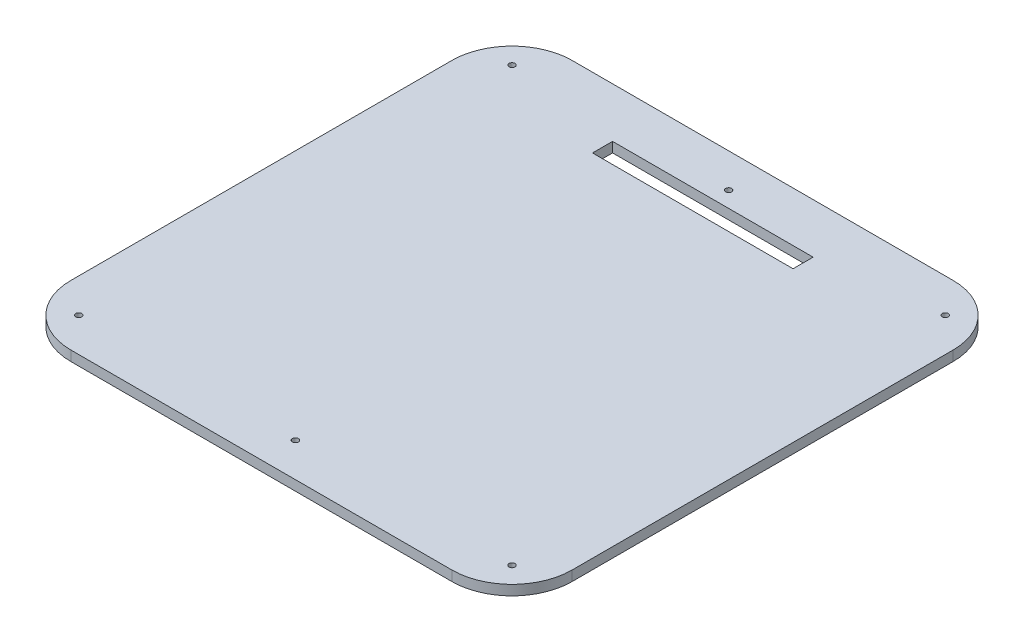
ISO-10303-21;
HEADER;
FILE_DESCRIPTION(('STEP AP214'),'2;1');
FILE_NAME('part.step','',(''),(''),'','','');
FILE_SCHEMA(('AUTOMOTIVE_DESIGN { 1 0 10303 214 1 1 1 1 }'));
ENDSEC;
DATA;
#1=APPLICATION_CONTEXT('core data for automotive mechanical design processes');
#2=APPLICATION_PROTOCOL_DEFINITION('international standard','automotive_design',2000,#1);
#3=PRODUCT_CONTEXT('',#1,'mechanical');
#4=PRODUCT('Part','Part','',(#3));
#5=PRODUCT_RELATED_PRODUCT_CATEGORY('part','',(#4));
#6=PRODUCT_DEFINITION_FORMATION('','',#4);
#7=PRODUCT_DEFINITION_CONTEXT('part definition',#1,'design');
#8=PRODUCT_DEFINITION('design','',#6,#7);
#9=PRODUCT_DEFINITION_SHAPE('','',#8);
#10=(LENGTH_UNIT() NAMED_UNIT(*) SI_UNIT(.MILLI.,.METRE.));
#11=(NAMED_UNIT(*) PLANE_ANGLE_UNIT() SI_UNIT($,.RADIAN.));
#12=(NAMED_UNIT(*) SI_UNIT($,.STERADIAN.) SOLID_ANGLE_UNIT());
#13=UNCERTAINTY_MEASURE_WITH_UNIT(LENGTH_MEASURE(1.E-05),#10,'distance_accuracy_value','');
#14=(GEOMETRIC_REPRESENTATION_CONTEXT(3) GLOBAL_UNCERTAINTY_ASSIGNED_CONTEXT((#13)) GLOBAL_UNIT_ASSIGNED_CONTEXT((#10,
#11,#12)) REPRESENTATION_CONTEXT('',''));
#15=CARTESIAN_POINT('',(0.,0.,0.));
#16=DIRECTION('',(0.,0.,1.));
#17=DIRECTION('',(1.,0.,0.));
#18=AXIS2_PLACEMENT_3D('',#15,#16,#17);
#19=CARTESIAN_POINT('',(125.,2.5,-125.));
#20=DIRECTION('',(-1.,0.,0.));
#21=DIRECTION('',(0.,0.,1.));
#22=AXIS2_PLACEMENT_3D('',#19,#20,#21);
#23=PLANE('',#22);
#24=DIRECTION('',(0.,0.,-1.));
#25=VECTOR('',#24,1.);
#26=CARTESIAN_POINT('',(125.,2.5,-125.));
#27=LINE('',#26,#25);
#28=CARTESIAN_POINT('',(125.,2.5,95.));
#29=VERTEX_POINT('',#28);
#30=CARTESIAN_POINT('',(125.,2.5,-95.));
#31=VERTEX_POINT('',#30);
#32=EDGE_CURVE('E173',#29,#31,#27,.T.);
#33=ORIENTED_EDGE('',*,*,#32,.F.);
#34=DIRECTION('',(0.,-1.,0.));
#35=VECTOR('',#34,1.);
#36=CARTESIAN_POINT('',(125.,2.5,95.));
#37=LINE('',#36,#35);
#38=CARTESIAN_POINT('',(125.,-2.5,95.));
#39=VERTEX_POINT('',#38);
#40=EDGE_CURVE('E220',#29,#39,#37,.T.);
#41=ORIENTED_EDGE('',*,*,#40,.T.);
#42=DIRECTION('',(0.,0.,-1.));
#43=VECTOR('',#42,1.);
#44=CARTESIAN_POINT('',(125.,-2.5,-125.));
#45=LINE('',#44,#43);
#46=CARTESIAN_POINT('',(125.,-2.5,-95.));
#47=VERTEX_POINT('',#46);
#48=EDGE_CURVE('E149',#39,#47,#45,.T.);
#49=ORIENTED_EDGE('',*,*,#48,.T.);
#50=DIRECTION('',(0.,-1.,0.));
#51=VECTOR('',#50,1.);
#52=CARTESIAN_POINT('',(125.,2.5,-95.));
#53=LINE('',#52,#51);
#54=EDGE_CURVE('E218',#47,#31,#53,.F.);
#55=ORIENTED_EDGE('',*,*,#54,.T.);
#56=EDGE_LOOP('',(#33,#41,#49,#55));
#57=FACE_BOUND('',#56,.T.);
#58=ADVANCED_FACE('F39',(#57),#23,.F.);
#59=CARTESIAN_POINT('',(-125.,2.5,-125.));
#60=DIRECTION('',(0.,0.,1.));
#61=DIRECTION('',(1.,0.,0.));
#62=AXIS2_PLACEMENT_3D('',#59,#60,#61);
#63=PLANE('',#62);
#64=DIRECTION('',(-1.,0.,0.));
#65=VECTOR('',#64,1.);
#66=CARTESIAN_POINT('',(-125.,2.5,-125.));
#67=LINE('',#66,#65);
#68=CARTESIAN_POINT('',(95.,2.5,-125.));
#69=VERTEX_POINT('',#68);
#70=CARTESIAN_POINT('',(-95.,2.5,-125.));
#71=VERTEX_POINT('',#70);
#72=EDGE_CURVE('E175',#69,#71,#67,.T.);
#73=ORIENTED_EDGE('',*,*,#72,.F.);
#74=DIRECTION('',(0.,-1.,0.));
#75=VECTOR('',#74,1.);
#76=CARTESIAN_POINT('',(95.,2.5,-125.));
#77=LINE('',#76,#75);
#78=CARTESIAN_POINT('',(95.,-2.5,-125.));
#79=VERTEX_POINT('',#78);
#80=EDGE_CURVE('E11',#69,#79,#77,.T.);
#81=ORIENTED_EDGE('',*,*,#80,.T.);
#82=DIRECTION('',(-1.,0.,0.));
#83=VECTOR('',#82,1.);
#84=CARTESIAN_POINT('',(-125.,-2.5,-125.));
#85=LINE('',#84,#83);
#86=CARTESIAN_POINT('',(-95.,-2.5,-125.));
#87=VERTEX_POINT('',#86);
#88=EDGE_CURVE('E187',#79,#87,#85,.T.);
#89=ORIENTED_EDGE('',*,*,#88,.T.);
#90=DIRECTION('',(0.,-1.,0.));
#91=VECTOR('',#90,1.);
#92=CARTESIAN_POINT('',(-95.,2.5,-125.));
#93=LINE('',#92,#91);
#94=EDGE_CURVE('E47',#87,#71,#93,.F.);
#95=ORIENTED_EDGE('',*,*,#94,.T.);
#96=EDGE_LOOP('',(#73,#81,#89,#95));
#97=FACE_BOUND('',#96,.T.);
#98=ADVANCED_FACE('F234',(#97),#63,.F.);
#99=CARTESIAN_POINT('',(-125.,2.5,-125.));
#100=DIRECTION('',(1.,0.,0.));
#101=DIRECTION('',(0.,0.,-1.));
#102=AXIS2_PLACEMENT_3D('',#99,#100,#101);
#103=PLANE('',#102);
#104=DIRECTION('',(0.,0.,1.));
#105=VECTOR('',#104,1.);
#106=CARTESIAN_POINT('',(-125.,-2.5,-125.));
#107=LINE('',#106,#105);
#108=CARTESIAN_POINT('',(-125.,-2.5,-95.));
#109=VERTEX_POINT('',#108);
#110=CARTESIAN_POINT('',(-125.,-2.5,95.));
#111=VERTEX_POINT('',#110);
#112=EDGE_CURVE('E189',#109,#111,#107,.T.);
#113=ORIENTED_EDGE('',*,*,#112,.T.);
#114=DIRECTION('',(0.,-1.,0.));
#115=VECTOR('',#114,1.);
#116=CARTESIAN_POINT('',(-125.,2.5,95.));
#117=LINE('',#116,#115);
#118=CARTESIAN_POINT('',(-125.,2.5,95.));
#119=VERTEX_POINT('',#118);
#120=EDGE_CURVE('E209',#111,#119,#117,.F.);
#121=ORIENTED_EDGE('',*,*,#120,.T.);
#122=DIRECTION('',(0.,0.,1.));
#123=VECTOR('',#122,1.);
#124=CARTESIAN_POINT('',(-125.,2.5,-125.));
#125=LINE('',#124,#123);
#126=CARTESIAN_POINT('',(-125.,2.5,-95.));
#127=VERTEX_POINT('',#126);
#128=EDGE_CURVE('E178',#127,#119,#125,.T.);
#129=ORIENTED_EDGE('',*,*,#128,.F.);
#130=DIRECTION('',(0.,-1.,0.));
#131=VECTOR('',#130,1.);
#132=CARTESIAN_POINT('',(-125.,2.5,-95.));
#133=LINE('',#132,#131);
#134=EDGE_CURVE('E206',#127,#109,#133,.T.);
#135=ORIENTED_EDGE('',*,*,#134,.T.);
#136=EDGE_LOOP('',(#113,#121,#129,#135));
#137=FACE_BOUND('',#136,.T.);
#138=ADVANCED_FACE('F242',(#137),#103,.F.);
#139=CARTESIAN_POINT('',(-125.,2.5,125.));
#140=DIRECTION('',(0.,0.,-1.));
#141=DIRECTION('',(-1.,0.,0.));
#142=AXIS2_PLACEMENT_3D('',#139,#140,#141);
#143=PLANE('',#142);
#144=DIRECTION('',(1.,0.,0.));
#145=VECTOR('',#144,1.);
#146=CARTESIAN_POINT('',(-125.,2.5,125.));
#147=LINE('',#146,#145);
#148=CARTESIAN_POINT('',(-95.,2.5,125.));
#149=VERTEX_POINT('',#148);
#150=CARTESIAN_POINT('',(95.,2.5,125.));
#151=VERTEX_POINT('',#150);
#152=EDGE_CURVE('E181',#149,#151,#147,.T.);
#153=ORIENTED_EDGE('',*,*,#152,.F.);
#154=DIRECTION('',(0.,-1.,0.));
#155=VECTOR('',#154,1.);
#156=CARTESIAN_POINT('',(-95.,2.5,125.));
#157=LINE('',#156,#155);
#158=CARTESIAN_POINT('',(-95.,-2.5,125.));
#159=VERTEX_POINT('',#158);
#160=EDGE_CURVE('E195',#149,#159,#157,.T.);
#161=ORIENTED_EDGE('',*,*,#160,.T.);
#162=DIRECTION('',(1.,0.,0.));
#163=VECTOR('',#162,1.);
#164=CARTESIAN_POINT('',(-125.,-2.5,125.));
#165=LINE('',#164,#163);
#166=CARTESIAN_POINT('',(95.,-2.5,125.));
#167=VERTEX_POINT('',#166);
#168=EDGE_CURVE('E176',#159,#167,#165,.T.);
#169=ORIENTED_EDGE('',*,*,#168,.T.);
#170=DIRECTION('',(0.,-1.,0.));
#171=VECTOR('',#170,1.);
#172=CARTESIAN_POINT('',(95.,2.5,125.));
#173=LINE('',#172,#171);
#174=EDGE_CURVE('E184',#167,#151,#173,.F.);
#175=ORIENTED_EDGE('',*,*,#174,.T.);
#176=EDGE_LOOP('',(#153,#161,#169,#175));
#177=FACE_BOUND('',#176,.T.);
#178=ADVANCED_FACE('F250',(#177),#143,.F.);
#179=CARTESIAN_POINT('',(0.,2.5,0.));
#180=DIRECTION('',(0.,1.,0.));
#181=DIRECTION('',(0.,0.,1.));
#182=AXIS2_PLACEMENT_3D('',#179,#180,#181);
#183=PLANE('',#182);
#184=CARTESIAN_POINT('',(-108.,2.5,108.));
#185=DIRECTION('',(0.,1.,0.));
#186=DIRECTION('',(0.,0.,-1.));
#187=AXIS2_PLACEMENT_3D('',#184,#185,#186);
#188=CIRCLE('',#187,1.5);
#189=CARTESIAN_POINT('',(-108.,2.5,106.5));
#190=VERTEX_POINT('',#189);
#191=EDGE_CURVE('E342',#190,#190,#188,.T.);
#192=ORIENTED_EDGE('',*,*,#191,.F.);
#193=EDGE_LOOP('',(#192));
#194=FACE_BOUND('',#193,.T.);
#195=CARTESIAN_POINT('',(0.,2.5,108.));
#196=DIRECTION('',(0.,1.,0.));
#197=DIRECTION('',(0.,0.,-1.));
#198=AXIS2_PLACEMENT_3D('',#195,#196,#197);
#199=CIRCLE('',#198,1.5);
#200=CARTESIAN_POINT('',(0.,2.5,106.5));
#201=VERTEX_POINT('',#200);
#202=EDGE_CURVE('E336',#201,#201,#199,.T.);
#203=ORIENTED_EDGE('',*,*,#202,.F.);
#204=EDGE_LOOP('',(#203));
#205=FACE_BOUND('',#204,.T.);
#206=CARTESIAN_POINT('',(108.,2.5,108.));
#207=DIRECTION('',(0.,1.,0.));
#208=DIRECTION('',(0.,0.,1.));
#209=AXIS2_PLACEMENT_3D('',#206,#207,#208);
#210=CIRCLE('',#209,1.5);
#211=CARTESIAN_POINT('',(108.,2.5,109.5));
#212=VERTEX_POINT('',#211);
#213=EDGE_CURVE('E331',#212,#212,#210,.T.);
#214=ORIENTED_EDGE('',*,*,#213,.F.);
#215=EDGE_LOOP('',(#214));
#216=FACE_BOUND('',#215,.T.);
#217=CARTESIAN_POINT('',(108.,2.5,-108.));
#218=DIRECTION('',(0.,1.,0.));
#219=DIRECTION('',(0.,0.,-1.));
#220=AXIS2_PLACEMENT_3D('',#217,#218,#219);
#221=CIRCLE('',#220,1.5);
#222=CARTESIAN_POINT('',(108.,2.5,-109.5));
#223=VERTEX_POINT('',#222);
#224=EDGE_CURVE('E322',#223,#223,#221,.T.);
#225=ORIENTED_EDGE('',*,*,#224,.F.);
#226=EDGE_LOOP('',(#225));
#227=FACE_BOUND('',#226,.T.);
#228=CARTESIAN_POINT('',(0.,2.5,-108.));
#229=DIRECTION('',(0.,1.,0.));
#230=DIRECTION('',(0.,0.,1.));
#231=AXIS2_PLACEMENT_3D('',#228,#229,#230);
#232=CIRCLE('',#231,1.5);
#233=CARTESIAN_POINT('',(0.,2.5,-106.5));
#234=VERTEX_POINT('',#233);
#235=EDGE_CURVE('E317',#234,#234,#232,.T.);
#236=ORIENTED_EDGE('',*,*,#235,.F.);
#237=EDGE_LOOP('',(#236));
#238=FACE_BOUND('',#237,.T.);
#239=CARTESIAN_POINT('',(-108.,2.5,-108.));
#240=DIRECTION('',(0.,1.,0.));
#241=DIRECTION('',(0.,0.,1.));
#242=AXIS2_PLACEMENT_3D('',#239,#240,#241);
#243=CIRCLE('',#242,1.5);
#244=CARTESIAN_POINT('',(-108.,2.5,-106.5));
#245=VERTEX_POINT('',#244);
#246=EDGE_CURVE('E324',#245,#245,#243,.T.);
#247=ORIENTED_EDGE('',*,*,#246,.F.);
#248=EDGE_LOOP('',(#247));
#249=FACE_BOUND('',#248,.T.);
#250=DIRECTION('',(0.,0.,-1.));
#251=VECTOR('',#250,1.);
#252=CARTESIAN_POINT('',(50.0000000000004,2.5,-100.139170265837));
#253=LINE('',#252,#251);
#254=CARTESIAN_POINT('',(50.0000000000004,2.5,-90.1391702658369));
#255=VERTEX_POINT('',#254);
#256=CARTESIAN_POINT('',(50.0000000000004,2.5,-100.139170265837));
#257=VERTEX_POINT('',#256);
#258=EDGE_CURVE('E136',#255,#257,#253,.T.);
#259=ORIENTED_EDGE('',*,*,#258,.F.);
#260=DIRECTION('',(1.,0.,0.));
#261=VECTOR('',#260,1.);
#262=CARTESIAN_POINT('',(-49.9999999999996,2.5,-90.1391702658369));
#263=LINE('',#262,#261);
#264=CARTESIAN_POINT('',(-49.9999999999996,2.5,-90.1391702658369));
#265=VERTEX_POINT('',#264);
#266=EDGE_CURVE('E141',#265,#255,#263,.T.);
#267=ORIENTED_EDGE('',*,*,#266,.F.);
#268=DIRECTION('',(0.,0.,1.));
#269=VECTOR('',#268,1.);
#270=CARTESIAN_POINT('',(-49.9999999999996,2.5,-100.139170265837));
#271=LINE('',#270,#269);
#272=CARTESIAN_POINT('',(-49.9999999999996,2.5,-100.139170265837));
#273=VERTEX_POINT('',#272);
#274=EDGE_CURVE('E164',#273,#265,#271,.T.);
#275=ORIENTED_EDGE('',*,*,#274,.F.);
#276=DIRECTION('',(-1.,0.,0.));
#277=VECTOR('',#276,1.);
#278=CARTESIAN_POINT('',(-49.9999999999996,2.5,-100.139170265837));
#279=LINE('',#278,#277);
#280=EDGE_CURVE('E157',#257,#273,#279,.T.);
#281=ORIENTED_EDGE('',*,*,#280,.F.);
#282=EDGE_LOOP('',(#259,#267,#275,#281));
#283=FACE_BOUND('',#282,.T.);
#284=ORIENTED_EDGE('',*,*,#128,.T.);
#285=CARTESIAN_POINT('',(-95.,2.5,95.));
#286=DIRECTION('',(0.,1.,0.));
#287=DIRECTION('',(0.,0.,1.));
#288=AXIS2_PLACEMENT_3D('',#285,#286,#287);
#289=CIRCLE('',#288,30.);
#290=EDGE_CURVE('E216',#119,#149,#289,.T.);
#291=ORIENTED_EDGE('',*,*,#290,.T.);
#292=ORIENTED_EDGE('',*,*,#152,.T.);
#293=CARTESIAN_POINT('',(95.,2.5,95.));
#294=DIRECTION('',(0.,1.,0.));
#295=DIRECTION('',(0.,0.,1.));
#296=AXIS2_PLACEMENT_3D('',#293,#294,#295);
#297=CIRCLE('',#296,30.);
#298=EDGE_CURVE('E214',#151,#29,#297,.T.);
#299=ORIENTED_EDGE('',*,*,#298,.T.);
#300=ORIENTED_EDGE('',*,*,#32,.T.);
#301=CARTESIAN_POINT('',(95.,2.5,-95.));
#302=DIRECTION('',(0.,1.,0.));
#303=DIRECTION('',(0.,0.,1.));
#304=AXIS2_PLACEMENT_3D('',#301,#302,#303);
#305=CIRCLE('',#304,30.);
#306=EDGE_CURVE('E60',#31,#69,#305,.T.);
#307=ORIENTED_EDGE('',*,*,#306,.T.);
#308=ORIENTED_EDGE('',*,*,#72,.T.);
#309=CARTESIAN_POINT('',(-95.,2.5,-95.));
#310=DIRECTION('',(0.,1.,0.));
#311=DIRECTION('',(0.,0.,1.));
#312=AXIS2_PLACEMENT_3D('',#309,#310,#311);
#313=CIRCLE('',#312,30.);
#314=EDGE_CURVE('E211',#71,#127,#313,.T.);
#315=ORIENTED_EDGE('',*,*,#314,.T.);
#316=EDGE_LOOP('',(#284,#291,#292,#299,#300,#307,#308,#315));
#317=FACE_BOUND('',#316,.T.);
#318=ADVANCED_FACE('F236',(#194,#205,#216,#227,#238,#249,#283,#317),#183,.T.);
#319=CARTESIAN_POINT('',(0.,-2.5,0.));
#320=DIRECTION('',(0.,1.,0.));
#321=DIRECTION('',(0.,0.,1.));
#322=AXIS2_PLACEMENT_3D('',#319,#320,#321);
#323=PLANE('',#322);
#324=CARTESIAN_POINT('',(-108.,-2.5,108.));
#325=DIRECTION('',(0.,1.,0.));
#326=DIRECTION('',(0.,0.,1.));
#327=AXIS2_PLACEMENT_3D('',#324,#325,#326);
#328=CIRCLE('',#327,1.5);
#329=CARTESIAN_POINT('',(-108.,-2.5,109.5));
#330=VERTEX_POINT('',#329);
#331=EDGE_CURVE('E345',#330,#330,#328,.F.);
#332=ORIENTED_EDGE('',*,*,#331,.F.);
#333=EDGE_LOOP('',(#332));
#334=FACE_BOUND('',#333,.T.);
#335=CARTESIAN_POINT('',(0.,-2.5,108.));
#336=DIRECTION('',(0.,1.,0.));
#337=DIRECTION('',(0.,0.,1.));
#338=AXIS2_PLACEMENT_3D('',#335,#336,#337);
#339=CIRCLE('',#338,1.5);
#340=CARTESIAN_POINT('',(0.,-2.5,109.5));
#341=VERTEX_POINT('',#340);
#342=EDGE_CURVE('E339',#341,#341,#339,.F.);
#343=ORIENTED_EDGE('',*,*,#342,.F.);
#344=EDGE_LOOP('',(#343));
#345=FACE_BOUND('',#344,.T.);
#346=CARTESIAN_POINT('',(108.,-2.5,108.));
#347=DIRECTION('',(0.,1.,0.));
#348=DIRECTION('',(0.,0.,1.));
#349=AXIS2_PLACEMENT_3D('',#346,#347,#348);
#350=CIRCLE('',#349,1.5);
#351=CARTESIAN_POINT('',(108.,-2.5,109.5));
#352=VERTEX_POINT('',#351);
#353=EDGE_CURVE('E333',#352,#352,#350,.F.);
#354=ORIENTED_EDGE('',*,*,#353,.F.);
#355=EDGE_LOOP('',(#354));
#356=FACE_BOUND('',#355,.T.);
#357=CARTESIAN_POINT('',(108.,-2.5,-108.));
#358=DIRECTION('',(0.,1.,0.));
#359=DIRECTION('',(0.,0.,1.));
#360=AXIS2_PLACEMENT_3D('',#357,#358,#359);
#361=CIRCLE('',#360,1.5);
#362=CARTESIAN_POINT('',(108.,-2.5,-106.5));
#363=VERTEX_POINT('',#362);
#364=EDGE_CURVE('E327',#363,#363,#361,.F.);
#365=ORIENTED_EDGE('',*,*,#364,.F.);
#366=EDGE_LOOP('',(#365));
#367=FACE_BOUND('',#366,.T.);
#368=CARTESIAN_POINT('',(0.,-2.5,-108.));
#369=DIRECTION('',(0.,1.,0.));
#370=DIRECTION('',(0.,0.,1.));
#371=AXIS2_PLACEMENT_3D('',#368,#369,#370);
#372=CIRCLE('',#371,1.5);
#373=CARTESIAN_POINT('',(0.,-2.5,-106.5));
#374=VERTEX_POINT('',#373);
#375=EDGE_CURVE('E320',#374,#374,#372,.F.);
#376=ORIENTED_EDGE('',*,*,#375,.F.);
#377=EDGE_LOOP('',(#376));
#378=FACE_BOUND('',#377,.T.);
#379=CARTESIAN_POINT('',(-108.,-2.5,-108.));
#380=DIRECTION('',(0.,1.,0.));
#381=DIRECTION('',(0.,0.,1.));
#382=AXIS2_PLACEMENT_3D('',#379,#380,#381);
#383=CIRCLE('',#382,1.5);
#384=CARTESIAN_POINT('',(-108.,-2.5,-106.5));
#385=VERTEX_POINT('',#384);
#386=EDGE_CURVE('E352',#385,#385,#383,.F.);
#387=ORIENTED_EDGE('',*,*,#386,.F.);
#388=EDGE_LOOP('',(#387));
#389=FACE_BOUND('',#388,.T.);
#390=DIRECTION('',(-1.,0.,0.));
#391=VECTOR('',#390,1.);
#392=CARTESIAN_POINT('',(-49.9999999999996,-2.5,-90.1391702658369));
#393=LINE('',#392,#391);
#394=CARTESIAN_POINT('',(50.0000000000004,-2.5,-90.1391702658369));
#395=VERTEX_POINT('',#394);
#396=CARTESIAN_POINT('',(-49.9999999999996,-2.5,-90.1391702658369));
#397=VERTEX_POINT('',#396);
#398=EDGE_CURVE('E155',#395,#397,#393,.T.);
#399=ORIENTED_EDGE('',*,*,#398,.F.);
#400=DIRECTION('',(0.,0.,1.));
#401=VECTOR('',#400,1.);
#402=CARTESIAN_POINT('',(50.0000000000004,-2.5,-100.139170265837));
#403=LINE('',#402,#401);
#404=CARTESIAN_POINT('',(50.0000000000004,-2.5,-100.139170265837));
#405=VERTEX_POINT('',#404);
#406=EDGE_CURVE('E133',#405,#395,#403,.T.);
#407=ORIENTED_EDGE('',*,*,#406,.F.);
#408=DIRECTION('',(1.,0.,0.));
#409=VECTOR('',#408,1.);
#410=CARTESIAN_POINT('',(-49.9999999999996,-2.5,-100.139170265837));
#411=LINE('',#410,#409);
#412=CARTESIAN_POINT('',(-49.9999999999996,-2.5,-100.139170265837));
#413=VERTEX_POINT('',#412);
#414=EDGE_CURVE('E145',#413,#405,#411,.T.);
#415=ORIENTED_EDGE('',*,*,#414,.F.);
#416=DIRECTION('',(0.,0.,-1.));
#417=VECTOR('',#416,1.);
#418=CARTESIAN_POINT('',(-49.9999999999996,-2.5,-100.139170265837));
#419=LINE('',#418,#417);
#420=EDGE_CURVE('E159',#397,#413,#419,.T.);
#421=ORIENTED_EDGE('',*,*,#420,.F.);
#422=EDGE_LOOP('',(#399,#407,#415,#421));
#423=FACE_BOUND('',#422,.T.);
#424=ORIENTED_EDGE('',*,*,#168,.F.);
#425=CARTESIAN_POINT('',(-95.,-2.5,95.));
#426=DIRECTION('',(0.,1.,0.));
#427=DIRECTION('',(0.,0.,1.));
#428=AXIS2_PLACEMENT_3D('',#425,#426,#427);
#429=CIRCLE('',#428,30.);
#430=EDGE_CURVE('E204',#159,#111,#429,.F.);
#431=ORIENTED_EDGE('',*,*,#430,.T.);
#432=ORIENTED_EDGE('',*,*,#112,.F.);
#433=CARTESIAN_POINT('',(-95.,-2.5,-95.));
#434=DIRECTION('',(0.,1.,0.));
#435=DIRECTION('',(0.,0.,1.));
#436=AXIS2_PLACEMENT_3D('',#433,#434,#435);
#437=CIRCLE('',#436,30.);
#438=EDGE_CURVE('E198',#109,#87,#437,.F.);
#439=ORIENTED_EDGE('',*,*,#438,.T.);
#440=ORIENTED_EDGE('',*,*,#88,.F.);
#441=CARTESIAN_POINT('',(95.,-2.5,-95.));
#442=DIRECTION('',(0.,1.,0.));
#443=DIRECTION('',(0.,0.,1.));
#444=AXIS2_PLACEMENT_3D('',#441,#442,#443);
#445=CIRCLE('',#444,30.);
#446=EDGE_CURVE('E200',#79,#47,#445,.F.);
#447=ORIENTED_EDGE('',*,*,#446,.T.);
#448=ORIENTED_EDGE('',*,*,#48,.F.);
#449=CARTESIAN_POINT('',(95.,-2.5,95.));
#450=DIRECTION('',(0.,1.,0.));
#451=DIRECTION('',(0.,0.,1.));
#452=AXIS2_PLACEMENT_3D('',#449,#450,#451);
#453=CIRCLE('',#452,30.);
#454=EDGE_CURVE('E202',#39,#167,#453,.F.);
#455=ORIENTED_EDGE('',*,*,#454,.T.);
#456=EDGE_LOOP('',(#424,#431,#432,#439,#440,#447,#448,#455));
#457=FACE_BOUND('',#456,.T.);
#458=ADVANCED_FACE('F152',(#334,#345,#356,#367,#378,#389,#423,#457),#323,.F.);
#459=CARTESIAN_POINT('',(50.0000000000004,-2.501,-100.139170265837));
#460=DIRECTION('',(1.,0.,0.));
#461=DIRECTION('',(0.,0.,-1.));
#462=AXIS2_PLACEMENT_3D('',#459,#460,#461);
#463=PLANE('',#462);
#464=ORIENTED_EDGE('',*,*,#406,.T.);
#465=DIRECTION('',(0.,1.,0.));
#466=VECTOR('',#465,1.);
#467=CARTESIAN_POINT('',(50.0000000000004,-2.501,-90.1391702658369));
#468=LINE('',#467,#466);
#469=EDGE_CURVE('E150',#395,#255,#468,.T.);
#470=ORIENTED_EDGE('',*,*,#469,.T.);
#471=ORIENTED_EDGE('',*,*,#258,.T.);
#472=DIRECTION('',(0.,1.,0.));
#473=VECTOR('',#472,1.);
#474=CARTESIAN_POINT('',(50.0000000000004,-2.501,-100.139170265837));
#475=LINE('',#474,#473);
#476=EDGE_CURVE('E129',#405,#257,#475,.T.);
#477=ORIENTED_EDGE('',*,*,#476,.F.);
#478=EDGE_LOOP('',(#464,#470,#471,#477));
#479=FACE_BOUND('',#478,.T.);
#480=ADVANCED_FACE('F131',(#479),#463,.F.);
#481=CARTESIAN_POINT('',(-49.9999999999996,-2.501,-90.1391702658369));
#482=DIRECTION('',(0.,0.,1.));
#483=DIRECTION('',(1.,0.,0.));
#484=AXIS2_PLACEMENT_3D('',#481,#482,#483);
#485=PLANE('',#484);
#486=ORIENTED_EDGE('',*,*,#398,.T.);
#487=DIRECTION('',(0.,1.,0.));
#488=VECTOR('',#487,1.);
#489=CARTESIAN_POINT('',(-49.9999999999996,-2.501,-90.1391702658369));
#490=LINE('',#489,#488);
#491=EDGE_CURVE('E170',#397,#265,#490,.T.);
#492=ORIENTED_EDGE('',*,*,#491,.T.);
#493=ORIENTED_EDGE('',*,*,#266,.T.);
#494=ORIENTED_EDGE('',*,*,#469,.F.);
#495=EDGE_LOOP('',(#486,#492,#493,#494));
#496=FACE_BOUND('',#495,.T.);
#497=ADVANCED_FACE('F281',(#496),#485,.F.);
#498=CARTESIAN_POINT('',(-49.9999999999996,-2.501,-100.139170265837));
#499=DIRECTION('',(-1.,0.,0.));
#500=DIRECTION('',(0.,0.,1.));
#501=AXIS2_PLACEMENT_3D('',#498,#499,#500);
#502=PLANE('',#501);
#503=ORIENTED_EDGE('',*,*,#420,.T.);
#504=DIRECTION('',(0.,1.,0.));
#505=VECTOR('',#504,1.);
#506=CARTESIAN_POINT('',(-49.9999999999996,-2.501,-100.139170265837));
#507=LINE('',#506,#505);
#508=EDGE_CURVE('E140',#413,#273,#507,.T.);
#509=ORIENTED_EDGE('',*,*,#508,.T.);
#510=ORIENTED_EDGE('',*,*,#274,.T.);
#511=ORIENTED_EDGE('',*,*,#491,.F.);
#512=EDGE_LOOP('',(#503,#509,#510,#511));
#513=FACE_BOUND('',#512,.T.);
#514=ADVANCED_FACE('F285',(#513),#502,.F.);
#515=CARTESIAN_POINT('',(-49.9999999999996,-2.501,-100.139170265837));
#516=DIRECTION('',(0.,0.,-1.));
#517=DIRECTION('',(-1.,0.,0.));
#518=AXIS2_PLACEMENT_3D('',#515,#516,#517);
#519=PLANE('',#518);
#520=ORIENTED_EDGE('',*,*,#414,.T.);
#521=ORIENTED_EDGE('',*,*,#476,.T.);
#522=ORIENTED_EDGE('',*,*,#280,.T.);
#523=ORIENTED_EDGE('',*,*,#508,.F.);
#524=EDGE_LOOP('',(#520,#521,#522,#523));
#525=FACE_BOUND('',#524,.T.);
#526=ADVANCED_FACE('F146',(#525),#519,.F.);
#527=CARTESIAN_POINT('',(-108.,-2.501,-108.));
#528=DIRECTION('',(0.,1.,0.));
#529=DIRECTION('',(0.,0.,1.));
#530=AXIS2_PLACEMENT_3D('',#527,#528,#529);
#531=CYLINDRICAL_SURFACE('',#530,1.5);
#532=ORIENTED_EDGE('',*,*,#246,.T.);
#533=EDGE_LOOP('',(#532));
#534=FACE_BOUND('',#533,.T.);
#535=ORIENTED_EDGE('',*,*,#386,.T.);
#536=EDGE_LOOP('',(#535));
#537=FACE_BOUND('',#536,.T.);
#538=ADVANCED_FACE('F284',(#534,#537),#531,.F.);
#539=CARTESIAN_POINT('',(0.,-2.501,-108.));
#540=DIRECTION('',(0.,1.,0.));
#541=DIRECTION('',(0.,0.,1.));
#542=AXIS2_PLACEMENT_3D('',#539,#540,#541);
#543=CYLINDRICAL_SURFACE('',#542,1.5);
#544=ORIENTED_EDGE('',*,*,#235,.T.);
#545=EDGE_LOOP('',(#544));
#546=FACE_BOUND('',#545,.T.);
#547=ORIENTED_EDGE('',*,*,#375,.T.);
#548=EDGE_LOOP('',(#547));
#549=FACE_BOUND('',#548,.T.);
#550=ADVANCED_FACE('F294',(#546,#549),#543,.F.);
#551=CARTESIAN_POINT('',(108.,-2.501,-108.));
#552=DIRECTION('',(0.,1.,0.));
#553=DIRECTION('',(0.,0.,1.));
#554=AXIS2_PLACEMENT_3D('',#551,#552,#553);
#555=CYLINDRICAL_SURFACE('',#554,1.5);
#556=ORIENTED_EDGE('',*,*,#224,.T.);
#557=EDGE_LOOP('',(#556));
#558=FACE_BOUND('',#557,.T.);
#559=ORIENTED_EDGE('',*,*,#364,.T.);
#560=EDGE_LOOP('',(#559));
#561=FACE_BOUND('',#560,.T.);
#562=ADVANCED_FACE('F305',(#558,#561),#555,.F.);
#563=CARTESIAN_POINT('',(108.,-2.501,108.));
#564=DIRECTION('',(0.,1.,0.));
#565=DIRECTION('',(0.,0.,1.));
#566=AXIS2_PLACEMENT_3D('',#563,#564,#565);
#567=CYLINDRICAL_SURFACE('',#566,1.5);
#568=ORIENTED_EDGE('',*,*,#213,.T.);
#569=EDGE_LOOP('',(#568));
#570=FACE_BOUND('',#569,.T.);
#571=ORIENTED_EDGE('',*,*,#353,.T.);
#572=EDGE_LOOP('',(#571));
#573=FACE_BOUND('',#572,.T.);
#574=ADVANCED_FACE('F301',(#570,#573),#567,.F.);
#575=CARTESIAN_POINT('',(0.,-2.501,108.));
#576=DIRECTION('',(0.,1.,0.));
#577=DIRECTION('',(0.,0.,1.));
#578=AXIS2_PLACEMENT_3D('',#575,#576,#577);
#579=CYLINDRICAL_SURFACE('',#578,1.5);
#580=ORIENTED_EDGE('',*,*,#202,.T.);
#581=EDGE_LOOP('',(#580));
#582=FACE_BOUND('',#581,.T.);
#583=ORIENTED_EDGE('',*,*,#342,.T.);
#584=EDGE_LOOP('',(#583));
#585=FACE_BOUND('',#584,.T.);
#586=ADVANCED_FACE('F297',(#582,#585),#579,.F.);
#587=CARTESIAN_POINT('',(-108.,-2.501,108.));
#588=DIRECTION('',(0.,1.,0.));
#589=DIRECTION('',(0.,0.,1.));
#590=AXIS2_PLACEMENT_3D('',#587,#588,#589);
#591=CYLINDRICAL_SURFACE('',#590,1.5);
#592=ORIENTED_EDGE('',*,*,#191,.T.);
#593=EDGE_LOOP('',(#592));
#594=FACE_BOUND('',#593,.T.);
#595=ORIENTED_EDGE('',*,*,#331,.T.);
#596=EDGE_LOOP('',(#595));
#597=FACE_BOUND('',#596,.T.);
#598=ADVANCED_FACE('F259',(#594,#597),#591,.F.);
#599=CARTESIAN_POINT('',(-95.,2.5,95.));
#600=DIRECTION('',(0.,-1.,0.));
#601=DIRECTION('',(0.,0.,-1.));
#602=AXIS2_PLACEMENT_3D('',#599,#600,#601);
#603=CYLINDRICAL_SURFACE('',#602,30.);
#604=ORIENTED_EDGE('',*,*,#290,.F.);
#605=ORIENTED_EDGE('',*,*,#120,.F.);
#606=ORIENTED_EDGE('',*,*,#430,.F.);
#607=ORIENTED_EDGE('',*,*,#160,.F.);
#608=EDGE_LOOP('',(#604,#605,#606,#607));
#609=FACE_BOUND('',#608,.T.);
#610=ADVANCED_FACE('F247',(#609),#603,.T.);
#611=CARTESIAN_POINT('',(95.,2.5,95.));
#612=DIRECTION('',(0.,-1.,0.));
#613=DIRECTION('',(0.,0.,-1.));
#614=AXIS2_PLACEMENT_3D('',#611,#612,#613);
#615=CYLINDRICAL_SURFACE('',#614,30.);
#616=ORIENTED_EDGE('',*,*,#298,.F.);
#617=ORIENTED_EDGE('',*,*,#174,.F.);
#618=ORIENTED_EDGE('',*,*,#454,.F.);
#619=ORIENTED_EDGE('',*,*,#40,.F.);
#620=EDGE_LOOP('',(#616,#617,#618,#619));
#621=FACE_BOUND('',#620,.T.);
#622=ADVANCED_FACE('F252',(#621),#615,.T.);
#623=CARTESIAN_POINT('',(95.,2.5,-95.));
#624=DIRECTION('',(0.,-1.,0.));
#625=DIRECTION('',(0.,0.,-1.));
#626=AXIS2_PLACEMENT_3D('',#623,#624,#625);
#627=CYLINDRICAL_SURFACE('',#626,30.);
#628=ORIENTED_EDGE('',*,*,#306,.F.);
#629=ORIENTED_EDGE('',*,*,#54,.F.);
#630=ORIENTED_EDGE('',*,*,#446,.F.);
#631=ORIENTED_EDGE('',*,*,#80,.F.);
#632=EDGE_LOOP('',(#628,#629,#630,#631));
#633=FACE_BOUND('',#632,.T.);
#634=ADVANCED_FACE('F233',(#633),#627,.T.);
#635=CARTESIAN_POINT('',(-95.,2.5,-95.));
#636=DIRECTION('',(0.,-1.,0.));
#637=DIRECTION('',(0.,0.,-1.));
#638=AXIS2_PLACEMENT_3D('',#635,#636,#637);
#639=CYLINDRICAL_SURFACE('',#638,30.);
#640=ORIENTED_EDGE('',*,*,#314,.F.);
#641=ORIENTED_EDGE('',*,*,#94,.F.);
#642=ORIENTED_EDGE('',*,*,#438,.F.);
#643=ORIENTED_EDGE('',*,*,#134,.F.);
#644=EDGE_LOOP('',(#640,#641,#642,#643));
#645=FACE_BOUND('',#644,.T.);
#646=ADVANCED_FACE('F41',(#645),#639,.T.);
#647=CLOSED_SHELL('',(#58,#98,#138,#178,#318,#458,#480,#497,#514,#526,#538,#550,#562,#574,#586,
#598,#610,#622,#634,#646));
#648=MANIFOLD_SOLID_BREP('B2',#647);
#649=ADVANCED_BREP_SHAPE_REPRESENTATION('',(#18,#648),#14);
#650=SHAPE_DEFINITION_REPRESENTATION(#9,#649);
ENDSEC;
END-ISO-10303-21;
